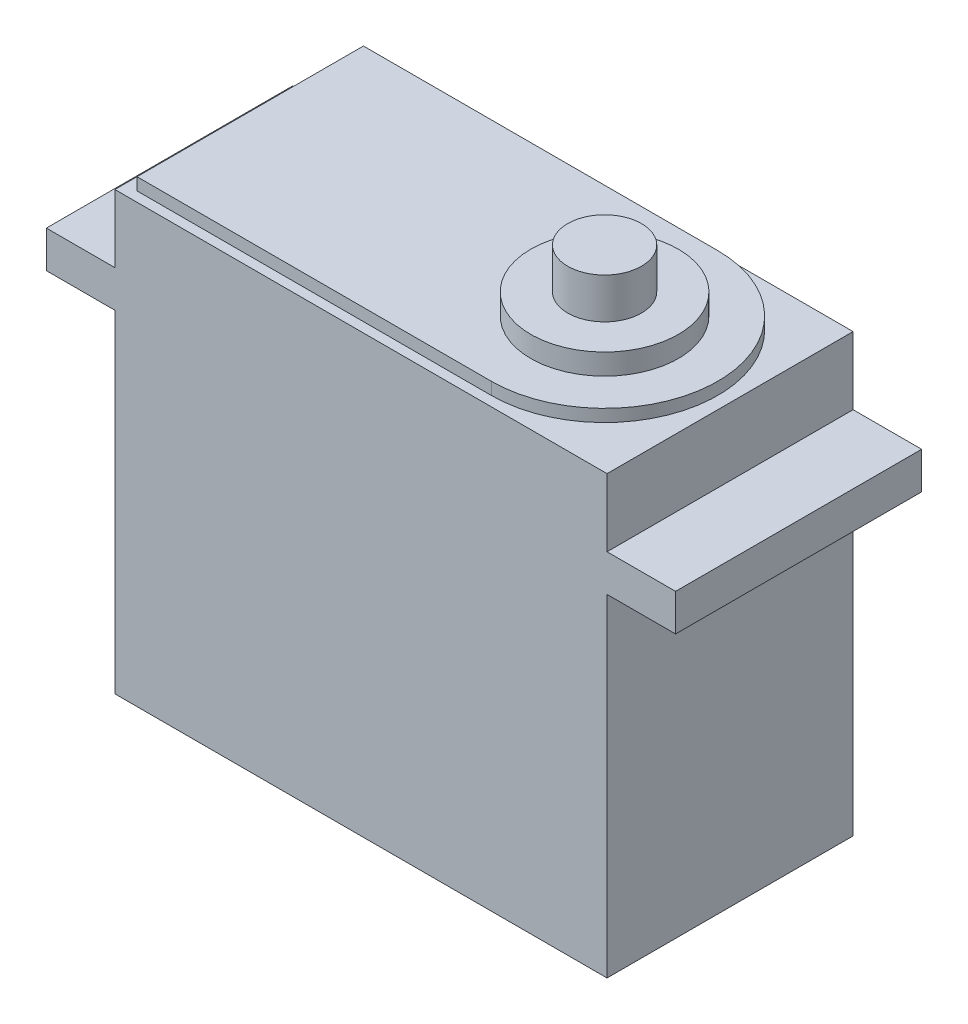
ISO-10303-21;
HEADER;
FILE_DESCRIPTION(('STEP AP214'),'2;1');
FILE_NAME('part.step','',(''),(''),'','','');
FILE_SCHEMA(('AUTOMOTIVE_DESIGN { 1 0 10303 214 1 1 1 1 }'));
ENDSEC;
DATA;
#1=APPLICATION_CONTEXT('core data for automotive mechanical design processes');
#2=APPLICATION_PROTOCOL_DEFINITION('international standard','automotive_design',2000,#1);
#3=PRODUCT_CONTEXT('',#1,'mechanical');
#4=PRODUCT('Part','Part','',(#3));
#5=PRODUCT_RELATED_PRODUCT_CATEGORY('part','',(#4));
#6=PRODUCT_DEFINITION_FORMATION('','',#4);
#7=PRODUCT_DEFINITION_CONTEXT('part definition',#1,'design');
#8=PRODUCT_DEFINITION('design','',#6,#7);
#9=PRODUCT_DEFINITION_SHAPE('','',#8);
#10=(LENGTH_UNIT() NAMED_UNIT(*) SI_UNIT(.MILLI.,.METRE.));
#11=(NAMED_UNIT(*) PLANE_ANGLE_UNIT() SI_UNIT($,.RADIAN.));
#12=(NAMED_UNIT(*) SI_UNIT($,.STERADIAN.) SOLID_ANGLE_UNIT());
#13=UNCERTAINTY_MEASURE_WITH_UNIT(LENGTH_MEASURE(1.E-05),#10,'distance_accuracy_value','');
#14=(GEOMETRIC_REPRESENTATION_CONTEXT(3) GLOBAL_UNCERTAINTY_ASSIGNED_CONTEXT((#13)) GLOBAL_UNIT_ASSIGNED_CONTEXT((#10,
#11,#12)) REPRESENTATION_CONTEXT('',''));
#15=CARTESIAN_POINT('',(0.,0.,0.));
#16=DIRECTION('',(0.,0.,1.));
#17=DIRECTION('',(1.,0.,0.));
#18=AXIS2_PLACEMENT_3D('',#15,#16,#17);
#19=CARTESIAN_POINT('',(20.,4.73208454498427,10.));
#20=DIRECTION('',(0.,-1.,0.));
#21=DIRECTION('',(1.,0.,0.));
#22=AXIS2_PLACEMENT_3D('',#19,#20,#21);
#23=PLANE('',#22);
#24=DIRECTION('',(-1.,0.,0.));
#25=VECTOR('',#24,1.);
#26=CARTESIAN_POINT('',(20.,4.73208454498427,-10.));
#27=LINE('',#26,#25);
#28=CARTESIAN_POINT('',(20.,4.73208454498427,-10.));
#29=VERTEX_POINT('',#28);
#30=CARTESIAN_POINT('',(-20.,4.73208454498424,-10.));
#31=VERTEX_POINT('',#30);
#32=EDGE_CURVE('E206',#29,#31,#27,.T.);
#33=ORIENTED_EDGE('',*,*,#32,.T.);
#34=DIRECTION('',(0.,0.,-1.));
#35=VECTOR('',#34,1.);
#36=CARTESIAN_POINT('',(-20.,4.73208454498424,10.));
#37=LINE('',#36,#35);
#38=CARTESIAN_POINT('',(-20.,4.73208454498424,10.));
#39=VERTEX_POINT('',#38);
#40=EDGE_CURVE('E246',#39,#31,#37,.T.);
#41=ORIENTED_EDGE('',*,*,#40,.F.);
#42=DIRECTION('',(-1.,0.,0.));
#43=VECTOR('',#42,1.);
#44=CARTESIAN_POINT('',(20.,4.73208454498427,10.));
#45=LINE('',#44,#43);
#46=CARTESIAN_POINT('',(20.,4.73208454498427,10.));
#47=VERTEX_POINT('',#46);
#48=EDGE_CURVE('E184',#47,#39,#45,.T.);
#49=ORIENTED_EDGE('',*,*,#48,.F.);
#50=DIRECTION('',(0.,0.,-1.));
#51=VECTOR('',#50,1.);
#52=CARTESIAN_POINT('',(20.,4.73208454498427,10.));
#53=LINE('',#52,#51);
#54=EDGE_CURVE('E249',#47,#29,#53,.T.);
#55=ORIENTED_EDGE('',*,*,#54,.T.);
#56=EDGE_LOOP('',(#33,#41,#49,#55));
#57=FACE_BOUND('',#56,.T.);
#58=DIRECTION('',(0.,0.,1.));
#59=VECTOR('',#58,1.);
#60=CARTESIAN_POINT('',(-19.,4.73208454498424,-9.2));
#61=LINE('',#60,#59);
#62=CARTESIAN_POINT('',(-19.,4.73208454498424,-9.2));
#63=VERTEX_POINT('',#62);
#64=CARTESIAN_POINT('',(-19.,4.73208454498424,9.2));
#65=VERTEX_POINT('',#64);
#66=EDGE_CURVE('E166',#63,#65,#61,.T.);
#67=ORIENTED_EDGE('',*,*,#66,.F.);
#68=DIRECTION('',(-1.,0.,0.));
#69=VECTOR('',#68,1.);
#70=CARTESIAN_POINT('',(-19.,4.73208454498424,-9.2));
#71=LINE('',#70,#69);
#72=CARTESIAN_POINT('',(9.8,4.73208454498426,-9.2));
#73=VERTEX_POINT('',#72);
#74=EDGE_CURVE('E163',#73,#63,#71,.T.);
#75=ORIENTED_EDGE('',*,*,#74,.F.);
#76=CARTESIAN_POINT('',(9.8,4.73208454498426,0.));
#77=DIRECTION('',(0.,1.,0.));
#78=DIRECTION('',(-1.,0.,0.));
#79=AXIS2_PLACEMENT_3D('',#76,#77,#78);
#80=CIRCLE('',#79,9.2);
#81=CARTESIAN_POINT('',(9.8,4.73208454498426,9.2));
#82=VERTEX_POINT('',#81);
#83=EDGE_CURVE('E53',#82,#73,#80,.T.);
#84=ORIENTED_EDGE('',*,*,#83,.F.);
#85=DIRECTION('',(1.,0.,0.));
#86=VECTOR('',#85,1.);
#87=CARTESIAN_POINT('',(-19.,4.73208454498424,9.2));
#88=LINE('',#87,#86);
#89=EDGE_CURVE('E48',#65,#82,#88,.T.);
#90=ORIENTED_EDGE('',*,*,#89,.F.);
#91=EDGE_LOOP('',(#67,#75,#84,#90));
#92=FACE_BOUND('',#91,.T.);
#93=ADVANCED_FACE('F32',(#57,#92),#23,.F.);
#94=CARTESIAN_POINT('',(25.5688776328022,-0.767915455015733,10.));
#95=DIRECTION('',(-1.,0.,0.));
#96=DIRECTION('',(0.,0.,1.));
#97=AXIS2_PLACEMENT_3D('',#94,#95,#96);
#98=PLANE('',#97);
#99=DIRECTION('',(0.,1.,0.));
#100=VECTOR('',#99,1.);
#101=CARTESIAN_POINT('',(25.5688776328022,-0.767915455015733,-10.));
#102=LINE('',#101,#100);
#103=CARTESIAN_POINT('',(25.5688776328022,-3.76791545501573,-10.));
#104=VERTEX_POINT('',#103);
#105=CARTESIAN_POINT('',(25.5688776328022,-0.767915455015733,-10.));
#106=VERTEX_POINT('',#105);
#107=EDGE_CURVE('E167',#104,#106,#102,.T.);
#108=ORIENTED_EDGE('',*,*,#107,.T.);
#109=DIRECTION('',(0.,0.,-1.));
#110=VECTOR('',#109,1.);
#111=CARTESIAN_POINT('',(25.5688776328022,-0.767915455015733,10.));
#112=LINE('',#111,#110);
#113=CARTESIAN_POINT('',(25.5688776328022,-0.767915455015733,10.));
#114=VERTEX_POINT('',#113);
#115=EDGE_CURVE('E11',#114,#106,#112,.T.);
#116=ORIENTED_EDGE('',*,*,#115,.F.);
#117=DIRECTION('',(0.,1.,0.));
#118=VECTOR('',#117,1.);
#119=CARTESIAN_POINT('',(25.5688776328022,-0.767915455015733,10.));
#120=LINE('',#119,#118);
#121=CARTESIAN_POINT('',(25.5688776328022,-3.76791545501573,10.));
#122=VERTEX_POINT('',#121);
#123=EDGE_CURVE('E176',#122,#114,#120,.T.);
#124=ORIENTED_EDGE('',*,*,#123,.F.);
#125=DIRECTION('',(0.,0.,-1.));
#126=VECTOR('',#125,1.);
#127=CARTESIAN_POINT('',(25.5688776328022,-3.76791545501573,10.));
#128=LINE('',#127,#126);
#129=EDGE_CURVE('E201',#122,#104,#128,.T.);
#130=ORIENTED_EDGE('',*,*,#129,.T.);
#131=EDGE_LOOP('',(#108,#116,#124,#130));
#132=FACE_BOUND('',#131,.T.);
#133=ADVANCED_FACE('F34',(#132),#98,.F.);
#134=CARTESIAN_POINT('',(20.,-0.767915455015733,10.));
#135=DIRECTION('',(0.,-1.,0.));
#136=DIRECTION('',(0.,0.,-1.));
#137=AXIS2_PLACEMENT_3D('',#134,#135,#136);
#138=PLANE('',#137);
#139=DIRECTION('',(-1.,0.,0.));
#140=VECTOR('',#139,1.);
#141=CARTESIAN_POINT('',(20.,-0.767915455015733,-10.));
#142=LINE('',#141,#140);
#143=CARTESIAN_POINT('',(20.,-0.767915455015733,-10.));
#144=VERTEX_POINT('',#143);
#145=EDGE_CURVE('E170',#106,#144,#142,.T.);
#146=ORIENTED_EDGE('',*,*,#145,.T.);
#147=DIRECTION('',(0.,0.,-1.));
#148=VECTOR('',#147,1.);
#149=CARTESIAN_POINT('',(20.,-0.767915455015733,10.));
#150=LINE('',#149,#148);
#151=CARTESIAN_POINT('',(20.,-0.767915455015733,10.));
#152=VERTEX_POINT('',#151);
#153=EDGE_CURVE('E41',#152,#144,#150,.T.);
#154=ORIENTED_EDGE('',*,*,#153,.F.);
#155=DIRECTION('',(-1.,0.,0.));
#156=VECTOR('',#155,1.);
#157=CARTESIAN_POINT('',(20.,-0.767915455015733,10.));
#158=LINE('',#157,#156);
#159=EDGE_CURVE('E179',#114,#152,#158,.T.);
#160=ORIENTED_EDGE('',*,*,#159,.F.);
#161=ORIENTED_EDGE('',*,*,#115,.T.);
#162=EDGE_LOOP('',(#146,#154,#160,#161));
#163=FACE_BOUND('',#162,.T.);
#164=ADVANCED_FACE('F279',(#163),#138,.F.);
#165=CARTESIAN_POINT('',(20.,-0.767915455015733,10.));
#166=DIRECTION('',(-1.,0.,0.));
#167=DIRECTION('',(0.,0.,1.));
#168=AXIS2_PLACEMENT_3D('',#165,#166,#167);
#169=PLANE('',#168);
#170=DIRECTION('',(0.,1.,0.));
#171=VECTOR('',#170,1.);
#172=CARTESIAN_POINT('',(20.,-0.767915455015733,-10.));
#173=LINE('',#172,#171);
#174=EDGE_CURVE('E204',#144,#29,#173,.T.);
#175=ORIENTED_EDGE('',*,*,#174,.T.);
#176=ORIENTED_EDGE('',*,*,#54,.F.);
#177=DIRECTION('',(0.,1.,0.));
#178=VECTOR('',#177,1.);
#179=CARTESIAN_POINT('',(20.,-0.767915455015733,10.));
#180=LINE('',#179,#178);
#181=EDGE_CURVE('E182',#152,#47,#180,.T.);
#182=ORIENTED_EDGE('',*,*,#181,.F.);
#183=ORIENTED_EDGE('',*,*,#153,.T.);
#184=EDGE_LOOP('',(#175,#176,#182,#183));
#185=FACE_BOUND('',#184,.T.);
#186=ADVANCED_FACE('F257',(#185),#169,.F.);
#187=CARTESIAN_POINT('',(-20.,-0.767915455015747,10.));
#188=DIRECTION('',(1.,0.,0.));
#189=DIRECTION('',(0.,0.,-1.));
#190=AXIS2_PLACEMENT_3D('',#187,#188,#189);
#191=PLANE('',#190);
#192=DIRECTION('',(0.,-1.,0.));
#193=VECTOR('',#192,1.);
#194=CARTESIAN_POINT('',(-20.,-0.767915455015747,-10.));
#195=LINE('',#194,#193);
#196=CARTESIAN_POINT('',(-20.,-0.767915455015747,-10.));
#197=VERTEX_POINT('',#196);
#198=EDGE_CURVE('E208',#31,#197,#195,.T.);
#199=ORIENTED_EDGE('',*,*,#198,.T.);
#200=DIRECTION('',(0.,0.,-1.));
#201=VECTOR('',#200,1.);
#202=CARTESIAN_POINT('',(-20.,-0.767915455015747,10.));
#203=LINE('',#202,#201);
#204=CARTESIAN_POINT('',(-20.,-0.767915455015747,10.));
#205=VERTEX_POINT('',#204);
#206=EDGE_CURVE('E243',#205,#197,#203,.T.);
#207=ORIENTED_EDGE('',*,*,#206,.F.);
#208=DIRECTION('',(0.,-1.,0.));
#209=VECTOR('',#208,1.);
#210=CARTESIAN_POINT('',(-20.,-0.767915455015747,10.));
#211=LINE('',#210,#209);
#212=EDGE_CURVE('E186',#39,#205,#211,.T.);
#213=ORIENTED_EDGE('',*,*,#212,.F.);
#214=ORIENTED_EDGE('',*,*,#40,.T.);
#215=EDGE_LOOP('',(#199,#207,#213,#214));
#216=FACE_BOUND('',#215,.T.);
#217=ADVANCED_FACE('F271',(#216),#191,.F.);
#218=CARTESIAN_POINT('',(-20.,-0.767915455015747,10.));
#219=DIRECTION('',(0.,-1.,0.));
#220=DIRECTION('',(0.,0.,-1.));
#221=AXIS2_PLACEMENT_3D('',#218,#219,#220);
#222=PLANE('',#221);
#223=DIRECTION('',(-1.,0.,0.));
#224=VECTOR('',#223,1.);
#225=CARTESIAN_POINT('',(-20.,-0.767915455015747,-10.));
#226=LINE('',#225,#224);
#227=CARTESIAN_POINT('',(-25.5688776328022,-0.767915455015747,-10.));
#228=VERTEX_POINT('',#227);
#229=EDGE_CURVE('E210',#197,#228,#226,.T.);
#230=ORIENTED_EDGE('',*,*,#229,.T.);
#231=DIRECTION('',(0.,0.,-1.));
#232=VECTOR('',#231,1.);
#233=CARTESIAN_POINT('',(-25.5688776328022,-0.767915455015747,10.));
#234=LINE('',#233,#232);
#235=CARTESIAN_POINT('',(-25.5688776328022,-0.767915455015747,10.));
#236=VERTEX_POINT('',#235);
#237=EDGE_CURVE('E240',#236,#228,#234,.T.);
#238=ORIENTED_EDGE('',*,*,#237,.F.);
#239=DIRECTION('',(-1.,0.,0.));
#240=VECTOR('',#239,1.);
#241=CARTESIAN_POINT('',(-20.,-0.767915455015747,10.));
#242=LINE('',#241,#240);
#243=EDGE_CURVE('E188',#205,#236,#242,.T.);
#244=ORIENTED_EDGE('',*,*,#243,.F.);
#245=ORIENTED_EDGE('',*,*,#206,.T.);
#246=EDGE_LOOP('',(#230,#238,#244,#245));
#247=FACE_BOUND('',#246,.T.);
#248=ADVANCED_FACE('F312',(#247),#222,.F.);
#249=CARTESIAN_POINT('',(-25.5688776328022,-0.767915455015747,10.));
#250=DIRECTION('',(1.,0.,0.));
#251=DIRECTION('',(0.,0.,-1.));
#252=AXIS2_PLACEMENT_3D('',#249,#250,#251);
#253=PLANE('',#252);
#254=DIRECTION('',(0.,-1.,0.));
#255=VECTOR('',#254,1.);
#256=CARTESIAN_POINT('',(-25.5688776328022,-0.767915455015747,-10.));
#257=LINE('',#256,#255);
#258=CARTESIAN_POINT('',(-25.5688776328022,-3.76791545501575,-10.));
#259=VERTEX_POINT('',#258);
#260=EDGE_CURVE('E212',#228,#259,#257,.T.);
#261=ORIENTED_EDGE('',*,*,#260,.T.);
#262=DIRECTION('',(0.,0.,-1.));
#263=VECTOR('',#262,1.);
#264=CARTESIAN_POINT('',(-25.5688776328022,-3.76791545501575,10.));
#265=LINE('',#264,#263);
#266=CARTESIAN_POINT('',(-25.5688776328022,-3.76791545501575,10.));
#267=VERTEX_POINT('',#266);
#268=EDGE_CURVE('E237',#267,#259,#265,.T.);
#269=ORIENTED_EDGE('',*,*,#268,.F.);
#270=DIRECTION('',(0.,-1.,0.));
#271=VECTOR('',#270,1.);
#272=CARTESIAN_POINT('',(-25.5688776328022,-0.767915455015747,10.));
#273=LINE('',#272,#271);
#274=EDGE_CURVE('E190',#236,#267,#273,.T.);
#275=ORIENTED_EDGE('',*,*,#274,.F.);
#276=ORIENTED_EDGE('',*,*,#237,.T.);
#277=EDGE_LOOP('',(#261,#269,#275,#276));
#278=FACE_BOUND('',#277,.T.);
#279=ADVANCED_FACE('F310',(#278),#253,.F.);
#280=CARTESIAN_POINT('',(-25.5688776328022,-3.76791545501575,10.));
#281=DIRECTION('',(0.,1.,0.));
#282=DIRECTION('',(-1.,0.,0.));
#283=AXIS2_PLACEMENT_3D('',#280,#281,#282);
#284=PLANE('',#283);
#285=DIRECTION('',(1.,0.,0.));
#286=VECTOR('',#285,1.);
#287=CARTESIAN_POINT('',(-25.5688776328022,-3.76791545501575,-10.));
#288=LINE('',#287,#286);
#289=CARTESIAN_POINT('',(-20.,-3.76791545501575,-10.));
#290=VERTEX_POINT('',#289);
#291=EDGE_CURVE('E214',#259,#290,#288,.T.);
#292=ORIENTED_EDGE('',*,*,#291,.T.);
#293=DIRECTION('',(0.,0.,-1.));
#294=VECTOR('',#293,1.);
#295=CARTESIAN_POINT('',(-20.,-3.76791545501575,10.));
#296=LINE('',#295,#294);
#297=CARTESIAN_POINT('',(-20.,-3.76791545501575,10.));
#298=VERTEX_POINT('',#297);
#299=EDGE_CURVE('E234',#298,#290,#296,.T.);
#300=ORIENTED_EDGE('',*,*,#299,.F.);
#301=DIRECTION('',(1.,0.,0.));
#302=VECTOR('',#301,1.);
#303=CARTESIAN_POINT('',(-25.5688776328022,-3.76791545501575,10.));
#304=LINE('',#303,#302);
#305=EDGE_CURVE('E192',#267,#298,#304,.T.);
#306=ORIENTED_EDGE('',*,*,#305,.F.);
#307=ORIENTED_EDGE('',*,*,#268,.T.);
#308=EDGE_LOOP('',(#292,#300,#306,#307));
#309=FACE_BOUND('',#308,.T.);
#310=ADVANCED_FACE('F306',(#309),#284,.F.);
#311=CARTESIAN_POINT('',(-20.,-3.76791545501575,10.));
#312=DIRECTION('',(1.,0.,0.));
#313=DIRECTION('',(0.,0.,-1.));
#314=AXIS2_PLACEMENT_3D('',#311,#312,#313);
#315=PLANE('',#314);
#316=DIRECTION('',(0.,-1.,0.));
#317=VECTOR('',#316,1.);
#318=CARTESIAN_POINT('',(-20.,-3.76791545501575,-10.));
#319=LINE('',#318,#317);
#320=CARTESIAN_POINT('',(-20.,-30.7679154550157,-10.));
#321=VERTEX_POINT('',#320);
#322=EDGE_CURVE('E216',#290,#321,#319,.T.);
#323=ORIENTED_EDGE('',*,*,#322,.T.);
#324=DIRECTION('',(0.,0.,-1.));
#325=VECTOR('',#324,1.);
#326=CARTESIAN_POINT('',(-20.,-30.7679154550157,10.));
#327=LINE('',#326,#325);
#328=CARTESIAN_POINT('',(-20.,-30.7679154550157,10.));
#329=VERTEX_POINT('',#328);
#330=EDGE_CURVE('E231',#329,#321,#327,.T.);
#331=ORIENTED_EDGE('',*,*,#330,.F.);
#332=DIRECTION('',(0.,-1.,0.));
#333=VECTOR('',#332,1.);
#334=CARTESIAN_POINT('',(-20.,-3.76791545501575,10.));
#335=LINE('',#334,#333);
#336=EDGE_CURVE('E194',#298,#329,#335,.T.);
#337=ORIENTED_EDGE('',*,*,#336,.F.);
#338=ORIENTED_EDGE('',*,*,#299,.T.);
#339=EDGE_LOOP('',(#323,#331,#337,#338));
#340=FACE_BOUND('',#339,.T.);
#341=ADVANCED_FACE('F301',(#340),#315,.F.);
#342=CARTESIAN_POINT('',(20.,-30.7679154550157,10.));
#343=DIRECTION('',(0.,1.,0.));
#344=DIRECTION('',(0.,0.,1.));
#345=AXIS2_PLACEMENT_3D('',#342,#343,#344);
#346=PLANE('',#345);
#347=DIRECTION('',(1.,0.,0.));
#348=VECTOR('',#347,1.);
#349=CARTESIAN_POINT('',(20.,-30.7679154550157,-10.));
#350=LINE('',#349,#348);
#351=CARTESIAN_POINT('',(20.,-30.7679154550157,-10.));
#352=VERTEX_POINT('',#351);
#353=EDGE_CURVE('E218',#321,#352,#350,.T.);
#354=ORIENTED_EDGE('',*,*,#353,.T.);
#355=DIRECTION('',(0.,0.,-1.));
#356=VECTOR('',#355,1.);
#357=CARTESIAN_POINT('',(20.,-30.7679154550157,10.));
#358=LINE('',#357,#356);
#359=CARTESIAN_POINT('',(20.,-30.7679154550157,10.));
#360=VERTEX_POINT('',#359);
#361=EDGE_CURVE('E228',#360,#352,#358,.T.);
#362=ORIENTED_EDGE('',*,*,#361,.F.);
#363=DIRECTION('',(1.,0.,0.));
#364=VECTOR('',#363,1.);
#365=CARTESIAN_POINT('',(20.,-30.7679154550157,10.));
#366=LINE('',#365,#364);
#367=EDGE_CURVE('E196',#329,#360,#366,.T.);
#368=ORIENTED_EDGE('',*,*,#367,.F.);
#369=ORIENTED_EDGE('',*,*,#330,.T.);
#370=EDGE_LOOP('',(#354,#362,#368,#369));
#371=FACE_BOUND('',#370,.T.);
#372=ADVANCED_FACE('F295',(#371),#346,.F.);
#373=CARTESIAN_POINT('',(20.,-3.76791545501573,10.));
#374=DIRECTION('',(-1.,0.,0.));
#375=DIRECTION('',(0.,0.,1.));
#376=AXIS2_PLACEMENT_3D('',#373,#374,#375);
#377=PLANE('',#376);
#378=DIRECTION('',(0.,1.,0.));
#379=VECTOR('',#378,1.);
#380=CARTESIAN_POINT('',(20.,-3.76791545501573,-10.));
#381=LINE('',#380,#379);
#382=CARTESIAN_POINT('',(20.,-3.76791545501573,-10.));
#383=VERTEX_POINT('',#382);
#384=EDGE_CURVE('E220',#352,#383,#381,.T.);
#385=ORIENTED_EDGE('',*,*,#384,.T.);
#386=DIRECTION('',(0.,0.,-1.));
#387=VECTOR('',#386,1.);
#388=CARTESIAN_POINT('',(20.,-3.76791545501573,10.));
#389=LINE('',#388,#387);
#390=CARTESIAN_POINT('',(20.,-3.76791545501573,10.));
#391=VERTEX_POINT('',#390);
#392=EDGE_CURVE('E225',#391,#383,#389,.T.);
#393=ORIENTED_EDGE('',*,*,#392,.F.);
#394=DIRECTION('',(0.,1.,0.));
#395=VECTOR('',#394,1.);
#396=CARTESIAN_POINT('',(20.,-3.76791545501573,10.));
#397=LINE('',#396,#395);
#398=EDGE_CURVE('E198',#360,#391,#397,.T.);
#399=ORIENTED_EDGE('',*,*,#398,.F.);
#400=ORIENTED_EDGE('',*,*,#361,.T.);
#401=EDGE_LOOP('',(#385,#393,#399,#400));
#402=FACE_BOUND('',#401,.T.);
#403=ADVANCED_FACE('F291',(#402),#377,.F.);
#404=CARTESIAN_POINT('',(25.5688776328022,-3.76791545501573,10.));
#405=DIRECTION('',(0.,1.,0.));
#406=DIRECTION('',(-1.,0.,0.));
#407=AXIS2_PLACEMENT_3D('',#404,#405,#406);
#408=PLANE('',#407);
#409=DIRECTION('',(1.,0.,0.));
#410=VECTOR('',#409,1.);
#411=CARTESIAN_POINT('',(25.5688776328022,-3.76791545501573,-10.));
#412=LINE('',#411,#410);
#413=EDGE_CURVE('E180',#383,#104,#412,.T.);
#414=ORIENTED_EDGE('',*,*,#413,.T.);
#415=ORIENTED_EDGE('',*,*,#129,.F.);
#416=DIRECTION('',(1.,0.,0.));
#417=VECTOR('',#416,1.);
#418=CARTESIAN_POINT('',(25.5688776328022,-3.76791545501573,10.));
#419=LINE('',#418,#417);
#420=EDGE_CURVE('E200',#391,#122,#419,.T.);
#421=ORIENTED_EDGE('',*,*,#420,.F.);
#422=ORIENTED_EDGE('',*,*,#392,.T.);
#423=EDGE_LOOP('',(#414,#415,#421,#422));
#424=FACE_BOUND('',#423,.T.);
#425=ADVANCED_FACE('F286',(#424),#408,.F.);
#426=CARTESIAN_POINT('',(0.,0.,10.));
#427=DIRECTION('',(0.,0.,-1.));
#428=DIRECTION('',(-1.,0.,0.));
#429=AXIS2_PLACEMENT_3D('',#426,#427,#428);
#430=PLANE('',#429);
#431=ORIENTED_EDGE('',*,*,#123,.T.);
#432=ORIENTED_EDGE('',*,*,#159,.T.);
#433=ORIENTED_EDGE('',*,*,#181,.T.);
#434=ORIENTED_EDGE('',*,*,#48,.T.);
#435=ORIENTED_EDGE('',*,*,#212,.T.);
#436=ORIENTED_EDGE('',*,*,#243,.T.);
#437=ORIENTED_EDGE('',*,*,#274,.T.);
#438=ORIENTED_EDGE('',*,*,#305,.T.);
#439=ORIENTED_EDGE('',*,*,#336,.T.);
#440=ORIENTED_EDGE('',*,*,#367,.T.);
#441=ORIENTED_EDGE('',*,*,#398,.T.);
#442=ORIENTED_EDGE('',*,*,#420,.T.);
#443=EDGE_LOOP('',(#431,#432,#433,#434,#435,#436,#437,#438,#439,#440,#441,#442));
#444=FACE_BOUND('',#443,.T.);
#445=ADVANCED_FACE('F275',(#444),#430,.F.);
#446=CARTESIAN_POINT('',(0.,0.,-10.));
#447=DIRECTION('',(0.,0.,-1.));
#448=DIRECTION('',(-1.,0.,0.));
#449=AXIS2_PLACEMENT_3D('',#446,#447,#448);
#450=PLANE('',#449);
#451=ORIENTED_EDGE('',*,*,#107,.F.);
#452=ORIENTED_EDGE('',*,*,#413,.F.);
#453=ORIENTED_EDGE('',*,*,#384,.F.);
#454=ORIENTED_EDGE('',*,*,#353,.F.);
#455=ORIENTED_EDGE('',*,*,#322,.F.);
#456=ORIENTED_EDGE('',*,*,#291,.F.);
#457=ORIENTED_EDGE('',*,*,#260,.F.);
#458=ORIENTED_EDGE('',*,*,#229,.F.);
#459=ORIENTED_EDGE('',*,*,#198,.F.);
#460=ORIENTED_EDGE('',*,*,#32,.F.);
#461=ORIENTED_EDGE('',*,*,#174,.F.);
#462=ORIENTED_EDGE('',*,*,#145,.F.);
#463=EDGE_LOOP('',(#451,#452,#453,#454,#455,#456,#457,#458,#459,#460,#461,#462));
#464=FACE_BOUND('',#463,.T.);
#465=ADVANCED_FACE('F263',(#464),#450,.T.);
#466=CARTESIAN_POINT('',(-19.,5.73208454498424,-9.2));
#467=DIRECTION('',(1.,0.,0.));
#468=DIRECTION('',(0.,1.,0.));
#469=AXIS2_PLACEMENT_3D('',#466,#467,#468);
#470=PLANE('',#469);
#471=ORIENTED_EDGE('',*,*,#66,.T.);
#472=DIRECTION('',(0.,-1.,0.));
#473=VECTOR('',#472,1.);
#474=CARTESIAN_POINT('',(-19.,5.73208454498424,9.2));
#475=LINE('',#474,#473);
#476=CARTESIAN_POINT('',(-19.,5.73208454498424,9.2));
#477=VERTEX_POINT('',#476);
#478=EDGE_CURVE('E147',#477,#65,#475,.T.);
#479=ORIENTED_EDGE('',*,*,#478,.F.);
#480=DIRECTION('',(0.,0.,1.));
#481=VECTOR('',#480,1.);
#482=CARTESIAN_POINT('',(-19.,5.73208454498424,-9.2));
#483=LINE('',#482,#481);
#484=CARTESIAN_POINT('',(-19.,5.73208454498424,-9.2));
#485=VERTEX_POINT('',#484);
#486=EDGE_CURVE('E154',#485,#477,#483,.T.);
#487=ORIENTED_EDGE('',*,*,#486,.F.);
#488=DIRECTION('',(0.,-1.,0.));
#489=VECTOR('',#488,1.);
#490=CARTESIAN_POINT('',(-19.,5.73208454498424,-9.2));
#491=LINE('',#490,#489);
#492=EDGE_CURVE('E514',#485,#63,#491,.T.);
#493=ORIENTED_EDGE('',*,*,#492,.T.);
#494=EDGE_LOOP('',(#471,#479,#487,#493));
#495=FACE_BOUND('',#494,.T.);
#496=ADVANCED_FACE('F165',(#495),#470,.F.);
#497=CARTESIAN_POINT('',(-19.,5.73208454498424,9.2));
#498=DIRECTION('',(0.,0.,-1.));
#499=DIRECTION('',(-1.,0.,0.));
#500=AXIS2_PLACEMENT_3D('',#497,#498,#499);
#501=PLANE('',#500);
#502=ORIENTED_EDGE('',*,*,#89,.T.);
#503=DIRECTION('',(0.,-1.,0.));
#504=VECTOR('',#503,1.);
#505=CARTESIAN_POINT('',(9.8,5.73208454498426,9.2));
#506=LINE('',#505,#504);
#507=CARTESIAN_POINT('',(9.8,5.73208454498426,9.2));
#508=VERTEX_POINT('',#507);
#509=EDGE_CURVE('E150',#508,#82,#506,.T.);
#510=ORIENTED_EDGE('',*,*,#509,.F.);
#511=DIRECTION('',(1.,0.,0.));
#512=VECTOR('',#511,1.);
#513=CARTESIAN_POINT('',(-19.,5.73208454498424,9.2));
#514=LINE('',#513,#512);
#515=EDGE_CURVE('E143',#477,#508,#514,.T.);
#516=ORIENTED_EDGE('',*,*,#515,.F.);
#517=ORIENTED_EDGE('',*,*,#478,.T.);
#518=EDGE_LOOP('',(#502,#510,#516,#517));
#519=FACE_BOUND('',#518,.T.);
#520=ADVANCED_FACE('F145',(#519),#501,.F.);
#521=CARTESIAN_POINT('',(9.8,5.73208454498426,0.));
#522=DIRECTION('',(0.,-1.,0.));
#523=DIRECTION('',(1.,0.,0.));
#524=AXIS2_PLACEMENT_3D('',#521,#522,#523);
#525=CYLINDRICAL_SURFACE('',#524,9.2);
#526=ORIENTED_EDGE('',*,*,#83,.T.);
#527=DIRECTION('',(0.,-1.,0.));
#528=VECTOR('',#527,1.);
#529=CARTESIAN_POINT('',(9.8,5.73208454498426,-9.2));
#530=LINE('',#529,#528);
#531=CARTESIAN_POINT('',(9.8,5.73208454498426,-9.2));
#532=VERTEX_POINT('',#531);
#533=EDGE_CURVE('E172',#532,#73,#530,.T.);
#534=ORIENTED_EDGE('',*,*,#533,.F.);
#535=CARTESIAN_POINT('',(9.8,5.73208454498426,0.));
#536=DIRECTION('',(0.,1.,0.));
#537=DIRECTION('',(-1.,0.,0.));
#538=AXIS2_PLACEMENT_3D('',#535,#536,#537);
#539=CIRCLE('',#538,9.2);
#540=EDGE_CURVE('E153',#508,#532,#539,.T.);
#541=ORIENTED_EDGE('',*,*,#540,.F.);
#542=ORIENTED_EDGE('',*,*,#509,.T.);
#543=EDGE_LOOP('',(#526,#534,#541,#542));
#544=FACE_BOUND('',#543,.T.);
#545=ADVANCED_FACE('F428',(#544),#525,.T.);
#546=CARTESIAN_POINT('',(-19.,5.73208454498424,-9.2));
#547=DIRECTION('',(0.,0.,1.));
#548=DIRECTION('',(1.,0.,0.));
#549=AXIS2_PLACEMENT_3D('',#546,#547,#548);
#550=PLANE('',#549);
#551=ORIENTED_EDGE('',*,*,#74,.T.);
#552=ORIENTED_EDGE('',*,*,#492,.F.);
#553=DIRECTION('',(-1.,0.,0.));
#554=VECTOR('',#553,1.);
#555=CARTESIAN_POINT('',(-19.,5.73208454498424,-9.2));
#556=LINE('',#555,#554);
#557=EDGE_CURVE('E159',#532,#485,#556,.T.);
#558=ORIENTED_EDGE('',*,*,#557,.F.);
#559=ORIENTED_EDGE('',*,*,#533,.T.);
#560=EDGE_LOOP('',(#551,#552,#558,#559));
#561=FACE_BOUND('',#560,.T.);
#562=ADVANCED_FACE('F437',(#561),#550,.F.);
#563=CARTESIAN_POINT('',(9.8,5.73208454498426,0.));
#564=DIRECTION('',(0.,1.,0.));
#565=DIRECTION('',(-1.,0.,0.));
#566=AXIS2_PLACEMENT_3D('',#563,#564,#565);
#567=PLANE('',#566);
#568=CARTESIAN_POINT('',(9.8,5.73208454498426,0.));
#569=DIRECTION('',(0.,1.,0.));
#570=DIRECTION('',(-1.,0.,0.));
#571=AXIS2_PLACEMENT_3D('',#568,#569,#570);
#572=CIRCLE('',#571,6.);
#573=CARTESIAN_POINT('',(3.8,5.73208454498426,0.));
#574=VERTEX_POINT('',#573);
#575=EDGE_CURVE('E510',#574,#574,#572,.T.);
#576=ORIENTED_EDGE('',*,*,#575,.F.);
#577=EDGE_LOOP('',(#576));
#578=FACE_BOUND('',#577,.T.);
#579=ORIENTED_EDGE('',*,*,#486,.T.);
#580=ORIENTED_EDGE('',*,*,#515,.T.);
#581=ORIENTED_EDGE('',*,*,#540,.T.);
#582=ORIENTED_EDGE('',*,*,#557,.T.);
#583=EDGE_LOOP('',(#579,#580,#581,#582));
#584=FACE_BOUND('',#583,.T.);
#585=ADVANCED_FACE('F157',(#578,#584),#567,.T.);
#586=CARTESIAN_POINT('',(9.8,7.43208454498426,0.));
#587=DIRECTION('',(0.,-1.,0.));
#588=DIRECTION('',(1.,0.,0.));
#589=AXIS2_PLACEMENT_3D('',#586,#587,#588);
#590=CYLINDRICAL_SURFACE('',#589,6.);
#591=CARTESIAN_POINT('',(9.8,7.43208454498426,0.));
#592=DIRECTION('',(0.,1.,0.));
#593=DIRECTION('',(-1.,0.,0.));
#594=AXIS2_PLACEMENT_3D('',#591,#592,#593);
#595=CIRCLE('',#594,6.);
#596=CARTESIAN_POINT('',(3.8,7.43208454498426,0.));
#597=VERTEX_POINT('',#596);
#598=EDGE_CURVE('E508',#597,#597,#595,.T.);
#599=ORIENTED_EDGE('',*,*,#598,.F.);
#600=EDGE_LOOP('',(#599));
#601=FACE_BOUND('',#600,.T.);
#602=ORIENTED_EDGE('',*,*,#575,.T.);
#603=EDGE_LOOP('',(#602));
#604=FACE_BOUND('',#603,.T.);
#605=ADVANCED_FACE('F472',(#601,#604),#590,.T.);
#606=CARTESIAN_POINT('',(9.8,7.43208454498426,0.));
#607=DIRECTION('',(0.,1.,0.));
#608=DIRECTION('',(-1.,0.,0.));
#609=AXIS2_PLACEMENT_3D('',#606,#607,#608);
#610=PLANE('',#609);
#611=CARTESIAN_POINT('',(9.8,7.43208454498426,0.));
#612=DIRECTION('',(0.,1.,0.));
#613=DIRECTION('',(-1.,0.,0.));
#614=AXIS2_PLACEMENT_3D('',#611,#612,#613);
#615=CIRCLE('',#614,3.);
#616=CARTESIAN_POINT('',(6.8,7.43208454498426,0.));
#617=VERTEX_POINT('',#616);
#618=EDGE_CURVE('E36',#617,#617,#615,.T.);
#619=ORIENTED_EDGE('',*,*,#618,.F.);
#620=EDGE_LOOP('',(#619));
#621=FACE_BOUND('',#620,.T.);
#622=ORIENTED_EDGE('',*,*,#598,.T.);
#623=EDGE_LOOP('',(#622));
#624=FACE_BOUND('',#623,.T.);
#625=ADVANCED_FACE('F460',(#621,#624),#610,.T.);
#626=CARTESIAN_POINT('',(9.8,10.7320845449843,0.));
#627=DIRECTION('',(0.,1.,0.));
#628=DIRECTION('',(-1.,0.,0.));
#629=AXIS2_PLACEMENT_3D('',#626,#627,#628);
#630=PLANE('',#629);
#631=CARTESIAN_POINT('',(9.8,10.7320845449843,0.));
#632=DIRECTION('',(0.,1.,0.));
#633=DIRECTION('',(-1.,0.,0.));
#634=AXIS2_PLACEMENT_3D('',#631,#632,#633);
#635=CIRCLE('',#634,3.);
#636=CARTESIAN_POINT('',(6.8,10.7320845449843,0.));
#637=VERTEX_POINT('',#636);
#638=EDGE_CURVE('E505',#637,#637,#635,.T.);
#639=ORIENTED_EDGE('',*,*,#638,.T.);
#640=EDGE_LOOP('',(#639));
#641=FACE_BOUND('',#640,.T.);
#642=ADVANCED_FACE('F454',(#641),#630,.T.);
#643=CARTESIAN_POINT('',(9.8,10.7320845449843,0.));
#644=DIRECTION('',(0.,-1.,0.));
#645=DIRECTION('',(1.,0.,0.));
#646=AXIS2_PLACEMENT_3D('',#643,#644,#645);
#647=CYLINDRICAL_SURFACE('',#646,3.);
#648=ORIENTED_EDGE('',*,*,#618,.T.);
#649=EDGE_LOOP('',(#648));
#650=FACE_BOUND('',#649,.T.);
#651=ORIENTED_EDGE('',*,*,#638,.F.);
#652=EDGE_LOOP('',(#651));
#653=FACE_BOUND('',#652,.T.);
#654=ADVANCED_FACE('F459',(#650,#653),#647,.T.);
#655=CLOSED_SHELL('',(#93,#133,#164,#186,#217,#248,#279,#310,#341,#372,#403,#425,#445,#465,#496,
#520,#545,#562,#585,#605,#625,#642,#654));
#656=MANIFOLD_SOLID_BREP('B2',#655);
#657=ADVANCED_BREP_SHAPE_REPRESENTATION('',(#18,#656),#14);
#658=SHAPE_DEFINITION_REPRESENTATION(#9,#657);
ENDSEC;
END-ISO-10303-21;
